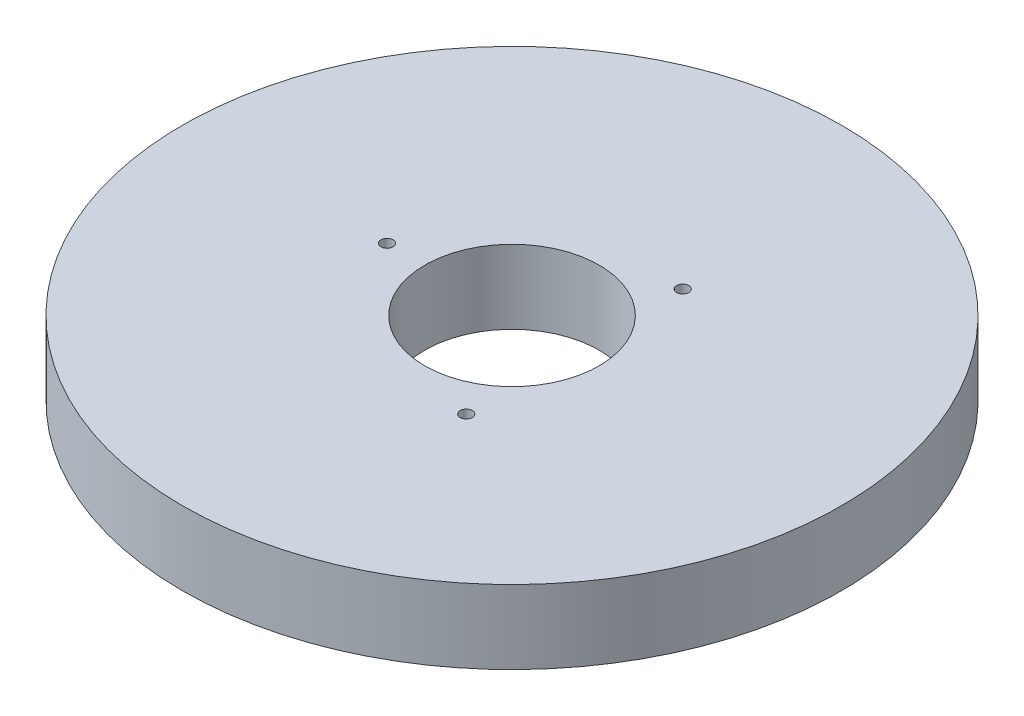
ISO-10303-21;
HEADER;
FILE_DESCRIPTION(('STEP AP214'),'2;1');
FILE_NAME('part.step','',(''),(''),'','','');
FILE_SCHEMA(('AUTOMOTIVE_DESIGN { 1 0 10303 214 1 1 1 1 }'));
ENDSEC;
DATA;
#1=APPLICATION_CONTEXT('core data for automotive mechanical design processes');
#2=APPLICATION_PROTOCOL_DEFINITION('international standard','automotive_design',2000,#1);
#3=PRODUCT_CONTEXT('',#1,'mechanical');
#4=PRODUCT('Part','Part','',(#3));
#5=PRODUCT_RELATED_PRODUCT_CATEGORY('part','',(#4));
#6=PRODUCT_DEFINITION_FORMATION('','',#4);
#7=PRODUCT_DEFINITION_CONTEXT('part definition',#1,'design');
#8=PRODUCT_DEFINITION('design','',#6,#7);
#9=PRODUCT_DEFINITION_SHAPE('','',#8);
#10=(LENGTH_UNIT() NAMED_UNIT(*) SI_UNIT(.MILLI.,.METRE.));
#11=(NAMED_UNIT(*) PLANE_ANGLE_UNIT() SI_UNIT($,.RADIAN.));
#12=(NAMED_UNIT(*) SI_UNIT($,.STERADIAN.) SOLID_ANGLE_UNIT());
#13=UNCERTAINTY_MEASURE_WITH_UNIT(LENGTH_MEASURE(1.E-05),#10,'distance_accuracy_value','');
#14=(GEOMETRIC_REPRESENTATION_CONTEXT(3) GLOBAL_UNCERTAINTY_ASSIGNED_CONTEXT((#13)) GLOBAL_UNIT_ASSIGNED_CONTEXT((#10,
#11,#12)) REPRESENTATION_CONTEXT('',''));
#15=CARTESIAN_POINT('',(0.,0.,0.));
#16=DIRECTION('',(0.,0.,1.));
#17=DIRECTION('',(1.,0.,0.));
#18=AXIS2_PLACEMENT_3D('',#15,#16,#17);
#19=CARTESIAN_POINT('',(0.,19.,0.));
#20=DIRECTION('',(0.,-1.,0.));
#21=DIRECTION('',(0.,0.,-1.));
#22=AXIS2_PLACEMENT_3D('',#19,#20,#21);
#23=CYLINDRICAL_SURFACE('',#22,85.);
#24=CARTESIAN_POINT('',(0.,19.,0.));
#25=DIRECTION('',(0.,1.,0.));
#26=DIRECTION('',(0.,0.,1.));
#27=AXIS2_PLACEMENT_3D('',#24,#25,#26);
#28=CIRCLE('',#27,85.);
#29=CARTESIAN_POINT('',(0.,19.,85.));
#30=VERTEX_POINT('',#29);
#31=EDGE_CURVE('E10',#30,#30,#28,.T.);
#32=ORIENTED_EDGE('',*,*,#31,.F.);
#33=EDGE_LOOP('',(#32));
#34=FACE_BOUND('',#33,.T.);
#35=CARTESIAN_POINT('',(0.,0.,0.));
#36=DIRECTION('',(0.,1.,0.));
#37=DIRECTION('',(0.,0.,1.));
#38=AXIS2_PLACEMENT_3D('',#35,#36,#37);
#39=CIRCLE('',#38,85.);
#40=CARTESIAN_POINT('',(0.,0.,85.));
#41=VERTEX_POINT('',#40);
#42=EDGE_CURVE('E37',#41,#41,#39,.T.);
#43=ORIENTED_EDGE('',*,*,#42,.T.);
#44=EDGE_LOOP('',(#43));
#45=FACE_BOUND('',#44,.T.);
#46=ADVANCED_FACE('F40',(#34,#45),#23,.T.);
#47=CARTESIAN_POINT('',(0.,19.,0.));
#48=DIRECTION('',(0.,1.,0.));
#49=DIRECTION('',(0.,0.,1.));
#50=AXIS2_PLACEMENT_3D('',#47,#48,#49);
#51=PLANE('',#50);
#52=CARTESIAN_POINT('',(16.1177056651388,19.,27.9166851134609));
#53=DIRECTION('',(0.,1.,0.));
#54=DIRECTION('',(0.866025403784436,0.,-0.500000000000004));
#55=AXIS2_PLACEMENT_3D('',#52,#53,#54);
#56=CIRCLE('',#55,1.56732978892608);
#57=CARTESIAN_POINT('',(17.4750530784569,19.,27.1330202189978));
#58=VERTEX_POINT('',#57);
#59=EDGE_CURVE('E70',#58,#58,#56,.T.);
#60=ORIENTED_EDGE('',*,*,#59,.F.);
#61=EDGE_LOOP('',(#60));
#62=FACE_BOUND('',#61,.T.);
#63=CARTESIAN_POINT('',(16.1177056651384,19.,-27.9166851134611));
#64=DIRECTION('',(0.,1.,0.));
#65=DIRECTION('',(-0.866025403784443,0.,-0.499999999999992));
#66=AXIS2_PLACEMENT_3D('',#63,#64,#65);
#67=CIRCLE('',#66,1.56732978892608);
#68=CARTESIAN_POINT('',(14.7603582518203,19.,-28.7003500079241));
#69=VERTEX_POINT('',#68);
#70=EDGE_CURVE('E61',#69,#69,#67,.T.);
#71=ORIENTED_EDGE('',*,*,#70,.F.);
#72=EDGE_LOOP('',(#71));
#73=FACE_BOUND('',#72,.T.);
#74=CARTESIAN_POINT('',(-32.2354113302774,19.,0.));
#75=DIRECTION('',(0.,1.,0.));
#76=DIRECTION('',(0.,0.,1.));
#77=AXIS2_PLACEMENT_3D('',#74,#75,#76);
#78=CIRCLE('',#77,1.56732978892608);
#79=CARTESIAN_POINT('',(-32.2354113302774,19.,1.56732978892608));
#80=VERTEX_POINT('',#79);
#81=EDGE_CURVE('E54',#80,#80,#78,.T.);
#82=ORIENTED_EDGE('',*,*,#81,.F.);
#83=EDGE_LOOP('',(#82));
#84=FACE_BOUND('',#83,.T.);
#85=CARTESIAN_POINT('',(0.,19.,0.));
#86=DIRECTION('',(0.,1.,0.));
#87=DIRECTION('',(0.,0.,1.));
#88=AXIS2_PLACEMENT_3D('',#85,#86,#87);
#89=CIRCLE('',#88,22.5);
#90=CARTESIAN_POINT('',(0.,19.,22.5));
#91=VERTEX_POINT('',#90);
#92=EDGE_CURVE('E50',#91,#91,#89,.T.);
#93=ORIENTED_EDGE('',*,*,#92,.F.);
#94=EDGE_LOOP('',(#93));
#95=FACE_BOUND('',#94,.T.);
#96=ORIENTED_EDGE('',*,*,#31,.T.);
#97=EDGE_LOOP('',(#96));
#98=FACE_BOUND('',#97,.T.);
#99=ADVANCED_FACE('F85',(#62,#73,#84,#95,#98),#51,.T.);
#100=CARTESIAN_POINT('',(0.,0.,0.));
#101=DIRECTION('',(0.,1.,0.));
#102=DIRECTION('',(0.,0.,1.));
#103=AXIS2_PLACEMENT_3D('',#100,#101,#102);
#104=PLANE('',#103);
#105=CARTESIAN_POINT('',(0.,0.,0.));
#106=DIRECTION('',(0.,1.,0.));
#107=DIRECTION('',(0.,0.,1.));
#108=AXIS2_PLACEMENT_3D('',#105,#106,#107);
#109=CIRCLE('',#108,22.5);
#110=CARTESIAN_POINT('',(0.,0.,22.5));
#111=VERTEX_POINT('',#110);
#112=EDGE_CURVE('E47',#111,#111,#109,.T.);
#113=ORIENTED_EDGE('',*,*,#112,.T.);
#114=EDGE_LOOP('',(#113));
#115=FACE_BOUND('',#114,.T.);
#116=ORIENTED_EDGE('',*,*,#42,.F.);
#117=EDGE_LOOP('',(#116));
#118=FACE_BOUND('',#117,.T.);
#119=ADVANCED_FACE('F84',(#115,#118),#104,.F.);
#120=CARTESIAN_POINT('',(0.,19.,0.));
#121=DIRECTION('',(0.,-1.,0.));
#122=DIRECTION('',(0.,0.,-1.));
#123=AXIS2_PLACEMENT_3D('',#120,#121,#122);
#124=CYLINDRICAL_SURFACE('',#123,22.5);
#125=ORIENTED_EDGE('',*,*,#92,.T.);
#126=EDGE_LOOP('',(#125));
#127=FACE_BOUND('',#126,.T.);
#128=ORIENTED_EDGE('',*,*,#112,.F.);
#129=EDGE_LOOP('',(#128));
#130=FACE_BOUND('',#129,.T.);
#131=ADVANCED_FACE('F91',(#127,#130),#124,.F.);
#132=CARTESIAN_POINT('',(-32.2354113302774,5.22732504692994,0.));
#133=DIRECTION('',(0.,1.,0.));
#134=DIRECTION('',(0.,0.,1.));
#135=AXIS2_PLACEMENT_3D('',#132,#133,#134);
#136=CYLINDRICAL_SURFACE('',#135,1.56732978892608);
#137=CARTESIAN_POINT('',(-32.2354113302774,5.22732504692994,0.));
#138=DIRECTION('',(0.,1.,0.));
#139=DIRECTION('',(0.,0.,1.));
#140=AXIS2_PLACEMENT_3D('',#137,#138,#139);
#141=CIRCLE('',#140,1.56732978892608);
#142=CARTESIAN_POINT('',(-32.2354113302774,5.22732504692994,1.56732978892608));
#143=VERTEX_POINT('',#142);
#144=EDGE_CURVE('E55',#143,#143,#141,.T.);
#145=ORIENTED_EDGE('',*,*,#144,.F.);
#146=EDGE_LOOP('',(#145));
#147=FACE_BOUND('',#146,.T.);
#148=ORIENTED_EDGE('',*,*,#81,.T.);
#149=EDGE_LOOP('',(#148));
#150=FACE_BOUND('',#149,.T.);
#151=ADVANCED_FACE('F96',(#147,#150),#136,.F.);
#152=CARTESIAN_POINT('',(-32.2354113302774,5.22732504692994,0.));
#153=DIRECTION('',(0.,1.,0.));
#154=DIRECTION('',(0.,0.,1.));
#155=AXIS2_PLACEMENT_3D('',#152,#153,#154);
#156=PLANE('',#155);
#157=ORIENTED_EDGE('',*,*,#144,.T.);
#158=EDGE_LOOP('',(#157));
#159=FACE_BOUND('',#158,.T.);
#160=ADVANCED_FACE('F127',(#159),#156,.T.);
#161=CARTESIAN_POINT('',(16.1177056651384,5.22732504692994,-27.9166851134611));
#162=DIRECTION('',(0.,1.,0.));
#163=DIRECTION('',(0.,0.,1.));
#164=AXIS2_PLACEMENT_3D('',#161,#162,#163);
#165=CYLINDRICAL_SURFACE('',#164,1.56732978892608);
#166=CARTESIAN_POINT('',(16.1177056651384,5.22732504692994,-27.9166851134611));
#167=DIRECTION('',(0.,1.,0.));
#168=DIRECTION('',(-0.866025403784443,0.,-0.499999999999992));
#169=AXIS2_PLACEMENT_3D('',#166,#167,#168);
#170=CIRCLE('',#169,1.56732978892608);
#171=CARTESIAN_POINT('',(14.7603582518203,5.22732504692994,-28.7003500079241));
#172=VERTEX_POINT('',#171);
#173=EDGE_CURVE('E63',#172,#172,#170,.T.);
#174=ORIENTED_EDGE('',*,*,#173,.F.);
#175=EDGE_LOOP('',(#174));
#176=FACE_BOUND('',#175,.T.);
#177=ORIENTED_EDGE('',*,*,#70,.T.);
#178=EDGE_LOOP('',(#177));
#179=FACE_BOUND('',#178,.T.);
#180=ADVANCED_FACE('F133',(#176,#179),#165,.F.);
#181=CARTESIAN_POINT('',(16.1177056651384,5.22732504692994,-27.9166851134611));
#182=DIRECTION('',(0.,1.,0.));
#183=DIRECTION('',(-0.866025403784443,0.,-0.499999999999992));
#184=AXIS2_PLACEMENT_3D('',#181,#182,#183);
#185=PLANE('',#184);
#186=ORIENTED_EDGE('',*,*,#173,.T.);
#187=EDGE_LOOP('',(#186));
#188=FACE_BOUND('',#187,.T.);
#189=ADVANCED_FACE('F77',(#188),#185,.T.);
#190=CARTESIAN_POINT('',(16.1177056651388,5.22732504692994,27.9166851134609));
#191=DIRECTION('',(0.,1.,0.));
#192=DIRECTION('',(0.,0.,1.));
#193=AXIS2_PLACEMENT_3D('',#190,#191,#192);
#194=CYLINDRICAL_SURFACE('',#193,1.56732978892608);
#195=CARTESIAN_POINT('',(16.1177056651388,5.22732504692994,27.9166851134609));
#196=DIRECTION('',(0.,1.,0.));
#197=DIRECTION('',(0.866025403784436,0.,-0.500000000000004));
#198=AXIS2_PLACEMENT_3D('',#195,#196,#197);
#199=CIRCLE('',#198,1.56732978892608);
#200=CARTESIAN_POINT('',(17.4750530784569,5.22732504692994,27.1330202189978));
#201=VERTEX_POINT('',#200);
#202=EDGE_CURVE('E59',#201,#201,#199,.T.);
#203=ORIENTED_EDGE('',*,*,#202,.F.);
#204=EDGE_LOOP('',(#203));
#205=FACE_BOUND('',#204,.T.);
#206=ORIENTED_EDGE('',*,*,#59,.T.);
#207=EDGE_LOOP('',(#206));
#208=FACE_BOUND('',#207,.T.);
#209=ADVANCED_FACE('F73',(#205,#208),#194,.F.);
#210=CARTESIAN_POINT('',(16.1177056651388,5.22732504692994,27.9166851134609));
#211=DIRECTION('',(0.,1.,0.));
#212=DIRECTION('',(0.866025403784436,0.,-0.500000000000004));
#213=AXIS2_PLACEMENT_3D('',#210,#211,#212);
#214=PLANE('',#213);
#215=ORIENTED_EDGE('',*,*,#202,.T.);
#216=EDGE_LOOP('',(#215));
#217=FACE_BOUND('',#216,.T.);
#218=ADVANCED_FACE('F71',(#217),#214,.T.);
#219=CLOSED_SHELL('',(#46,#99,#119,#131,#151,#160,#180,#189,#209,#218));
#220=MANIFOLD_SOLID_BREP('B2',#219);
#221=ADVANCED_BREP_SHAPE_REPRESENTATION('',(#18,#220),#14);
#222=SHAPE_DEFINITION_REPRESENTATION(#9,#221);
ENDSEC;
END-ISO-10303-21;
